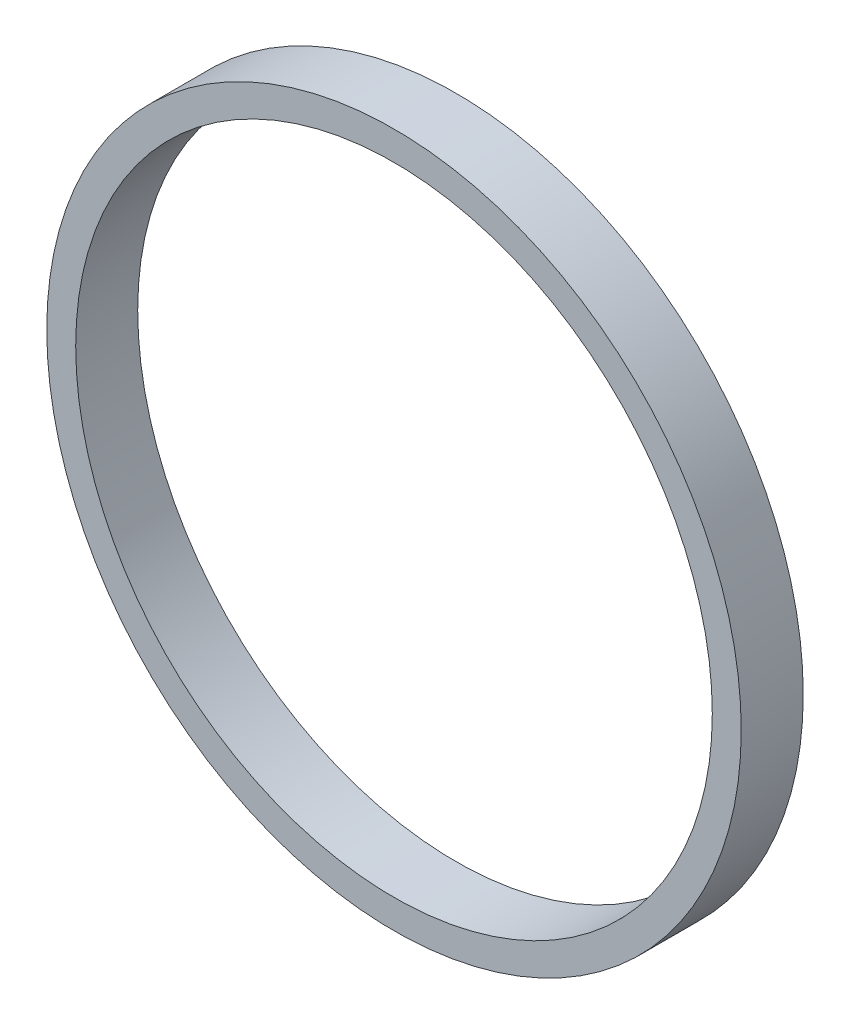
ISO-10303-21;
HEADER;
FILE_DESCRIPTION(('STEP AP214'),'2;1');
FILE_NAME('part.step','',(''),(''),'','','');
FILE_SCHEMA(('AUTOMOTIVE_DESIGN { 1 0 10303 214 1 1 1 1 }'));
ENDSEC;
DATA;
#1=APPLICATION_CONTEXT('core data for automotive mechanical design processes');
#2=APPLICATION_PROTOCOL_DEFINITION('international standard','automotive_design',2000,#1);
#3=PRODUCT_CONTEXT('',#1,'mechanical');
#4=PRODUCT('Part','Part','',(#3));
#5=PRODUCT_RELATED_PRODUCT_CATEGORY('part','',(#4));
#6=PRODUCT_DEFINITION_FORMATION('','',#4);
#7=PRODUCT_DEFINITION_CONTEXT('part definition',#1,'design');
#8=PRODUCT_DEFINITION('design','',#6,#7);
#9=PRODUCT_DEFINITION_SHAPE('','',#8);
#10=(LENGTH_UNIT() NAMED_UNIT(*) SI_UNIT(.MILLI.,.METRE.));
#11=(NAMED_UNIT(*) PLANE_ANGLE_UNIT() SI_UNIT($,.RADIAN.));
#12=(NAMED_UNIT(*) SI_UNIT($,.STERADIAN.) SOLID_ANGLE_UNIT());
#13=UNCERTAINTY_MEASURE_WITH_UNIT(LENGTH_MEASURE(1.E-05),#10,'distance_accuracy_value','');
#14=(GEOMETRIC_REPRESENTATION_CONTEXT(3) GLOBAL_UNCERTAINTY_ASSIGNED_CONTEXT((#13)) GLOBAL_UNIT_ASSIGNED_CONTEXT((#10,
#11,#12)) REPRESENTATION_CONTEXT('',''));
#15=CARTESIAN_POINT('',(0.,0.,0.));
#16=DIRECTION('',(0.,0.,1.));
#17=DIRECTION('',(1.,0.,0.));
#18=AXIS2_PLACEMENT_3D('',#15,#16,#17);
#19=CARTESIAN_POINT('',(0.,0.,15.));
#20=DIRECTION('',(0.,0.,1.));
#21=DIRECTION('',(1.,0.,0.));
#22=AXIS2_PLACEMENT_3D('',#19,#20,#21);
#23=PLANE('',#22);
#24=CARTESIAN_POINT('',(0.,0.,15.));
#25=DIRECTION('',(0.,0.,1.));
#26=DIRECTION('',(1.,0.,0.));
#27=AXIS2_PLACEMENT_3D('',#24,#25,#26);
#28=CIRCLE('',#27,84.);
#29=CARTESIAN_POINT('',(84.,0.,15.));
#30=VERTEX_POINT('',#29);
#31=EDGE_CURVE('E10',#30,#30,#28,.T.);
#32=ORIENTED_EDGE('',*,*,#31,.T.);
#33=EDGE_LOOP('',(#32));
#34=FACE_BOUND('',#33,.T.);
#35=CARTESIAN_POINT('',(0.,0.,15.));
#36=DIRECTION('',(0.,0.,1.));
#37=DIRECTION('',(1.,0.,0.));
#38=AXIS2_PLACEMENT_3D('',#35,#36,#37);
#39=CIRCLE('',#38,77.);
#40=CARTESIAN_POINT('',(77.,0.,15.));
#41=VERTEX_POINT('',#40);
#42=EDGE_CURVE('E44',#41,#41,#39,.T.);
#43=ORIENTED_EDGE('',*,*,#42,.F.);
#44=EDGE_LOOP('',(#43));
#45=FACE_BOUND('',#44,.T.);
#46=ADVANCED_FACE('F33',(#34,#45),#23,.T.);
#47=CARTESIAN_POINT('',(0.,0.,0.));
#48=DIRECTION('',(0.,0.,1.));
#49=DIRECTION('',(1.,0.,0.));
#50=AXIS2_PLACEMENT_3D('',#47,#48,#49);
#51=PLANE('',#50);
#52=CARTESIAN_POINT('',(0.,0.,0.));
#53=DIRECTION('',(0.,0.,1.));
#54=DIRECTION('',(1.,0.,0.));
#55=AXIS2_PLACEMENT_3D('',#52,#53,#54);
#56=CIRCLE('',#55,84.);
#57=CARTESIAN_POINT('',(84.,0.,0.));
#58=VERTEX_POINT('',#57);
#59=EDGE_CURVE('E37',#58,#58,#56,.T.);
#60=ORIENTED_EDGE('',*,*,#59,.F.);
#61=EDGE_LOOP('',(#60));
#62=FACE_BOUND('',#61,.T.);
#63=CARTESIAN_POINT('',(0.,0.,0.));
#64=DIRECTION('',(0.,0.,1.));
#65=DIRECTION('',(1.,0.,0.));
#66=AXIS2_PLACEMENT_3D('',#63,#64,#65);
#67=CIRCLE('',#66,77.);
#68=CARTESIAN_POINT('',(77.,0.,0.));
#69=VERTEX_POINT('',#68);
#70=EDGE_CURVE('E46',#69,#69,#67,.T.);
#71=ORIENTED_EDGE('',*,*,#70,.T.);
#72=EDGE_LOOP('',(#71));
#73=FACE_BOUND('',#72,.T.);
#74=ADVANCED_FACE('F56',(#62,#73),#51,.F.);
#75=CARTESIAN_POINT('',(0.,0.,15.));
#76=DIRECTION('',(0.,0.,-1.));
#77=DIRECTION('',(-1.,0.,0.));
#78=AXIS2_PLACEMENT_3D('',#75,#76,#77);
#79=CYLINDRICAL_SURFACE('',#78,84.);
#80=ORIENTED_EDGE('',*,*,#31,.F.);
#81=EDGE_LOOP('',(#80));
#82=FACE_BOUND('',#81,.T.);
#83=ORIENTED_EDGE('',*,*,#59,.T.);
#84=EDGE_LOOP('',(#83));
#85=FACE_BOUND('',#84,.T.);
#86=ADVANCED_FACE('F35',(#82,#85),#79,.T.);
#87=CARTESIAN_POINT('',(0.,0.,15.));
#88=DIRECTION('',(0.,0.,-1.));
#89=DIRECTION('',(-1.,0.,0.));
#90=AXIS2_PLACEMENT_3D('',#87,#88,#89);
#91=CYLINDRICAL_SURFACE('',#90,77.);
#92=ORIENTED_EDGE('',*,*,#42,.T.);
#93=EDGE_LOOP('',(#92));
#94=FACE_BOUND('',#93,.T.);
#95=ORIENTED_EDGE('',*,*,#70,.F.);
#96=EDGE_LOOP('',(#95));
#97=FACE_BOUND('',#96,.T.);
#98=ADVANCED_FACE('F52',(#94,#97),#91,.F.);
#99=CLOSED_SHELL('',(#46,#74,#86,#98));
#100=MANIFOLD_SOLID_BREP('B2',#99);
#101=ADVANCED_BREP_SHAPE_REPRESENTATION('',(#18,#100),#14);
#102=SHAPE_DEFINITION_REPRESENTATION(#9,#101);
ENDSEC;
END-ISO-10303-21;
